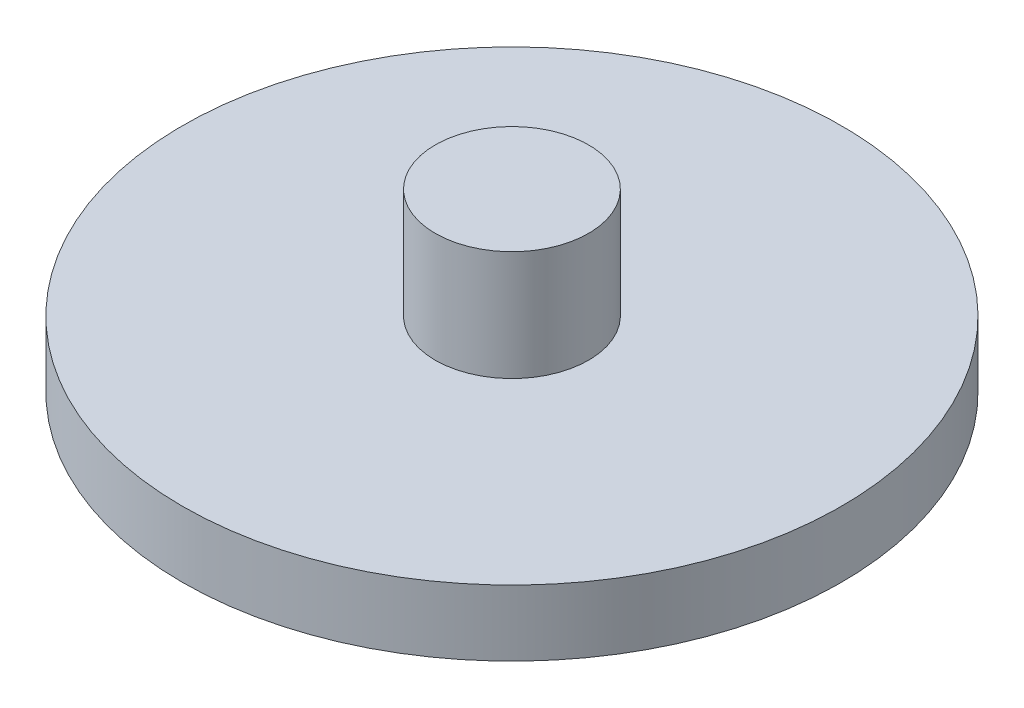
ISO-10303-21;
HEADER;
FILE_DESCRIPTION(('STEP AP214'),'2;1');
FILE_NAME('part.step','',(''),(''),'','','');
FILE_SCHEMA(('AUTOMOTIVE_DESIGN { 1 0 10303 214 1 1 1 1 }'));
ENDSEC;
DATA;
#1=APPLICATION_CONTEXT('core data for automotive mechanical design processes');
#2=APPLICATION_PROTOCOL_DEFINITION('international standard','automotive_design',2000,#1);
#3=PRODUCT_CONTEXT('',#1,'mechanical');
#4=PRODUCT('Part','Part','',(#3));
#5=PRODUCT_RELATED_PRODUCT_CATEGORY('part','',(#4));
#6=PRODUCT_DEFINITION_FORMATION('','',#4);
#7=PRODUCT_DEFINITION_CONTEXT('part definition',#1,'design');
#8=PRODUCT_DEFINITION('design','',#6,#7);
#9=PRODUCT_DEFINITION_SHAPE('','',#8);
#10=(LENGTH_UNIT() NAMED_UNIT(*) SI_UNIT(.MILLI.,.METRE.));
#11=(NAMED_UNIT(*) PLANE_ANGLE_UNIT() SI_UNIT($,.RADIAN.));
#12=(NAMED_UNIT(*) SI_UNIT($,.STERADIAN.) SOLID_ANGLE_UNIT());
#13=UNCERTAINTY_MEASURE_WITH_UNIT(LENGTH_MEASURE(1.E-05),#10,'distance_accuracy_value','');
#14=(GEOMETRIC_REPRESENTATION_CONTEXT(3) GLOBAL_UNCERTAINTY_ASSIGNED_CONTEXT((#13)) GLOBAL_UNIT_ASSIGNED_CONTEXT((#10,
#11,#12)) REPRESENTATION_CONTEXT('',''));
#15=CARTESIAN_POINT('',(0.,0.,0.));
#16=DIRECTION('',(0.,0.,1.));
#17=DIRECTION('',(1.,0.,0.));
#18=AXIS2_PLACEMENT_3D('',#15,#16,#17);
#19=CARTESIAN_POINT('',(0.,3.,0.));
#20=DIRECTION('',(0.,-1.,0.));
#21=DIRECTION('',(0.,0.,-1.));
#22=AXIS2_PLACEMENT_3D('',#19,#20,#21);
#23=CYLINDRICAL_SURFACE('',#22,15.);
#24=CARTESIAN_POINT('',(0.,3.,0.));
#25=DIRECTION('',(0.,1.,0.));
#26=DIRECTION('',(0.,0.,1.));
#27=AXIS2_PLACEMENT_3D('',#24,#25,#26);
#28=CIRCLE('',#27,15.);
#29=CARTESIAN_POINT('',(0.,3.,15.));
#30=VERTEX_POINT('',#29);
#31=EDGE_CURVE('E45',#30,#30,#28,.T.);
#32=ORIENTED_EDGE('',*,*,#31,.F.);
#33=EDGE_LOOP('',(#32));
#34=FACE_BOUND('',#33,.T.);
#35=CARTESIAN_POINT('',(0.,0.,0.));
#36=DIRECTION('',(0.,1.,0.));
#37=DIRECTION('',(0.,0.,1.));
#38=AXIS2_PLACEMENT_3D('',#35,#36,#37);
#39=CIRCLE('',#38,15.);
#40=CARTESIAN_POINT('',(0.,0.,15.));
#41=VERTEX_POINT('',#40);
#42=EDGE_CURVE('E40',#41,#41,#39,.T.);
#43=ORIENTED_EDGE('',*,*,#42,.T.);
#44=EDGE_LOOP('',(#43));
#45=FACE_BOUND('',#44,.T.);
#46=ADVANCED_FACE('F37',(#34,#45),#23,.T.);
#47=CARTESIAN_POINT('',(0.,3.,0.));
#48=DIRECTION('',(0.,1.,0.));
#49=DIRECTION('',(0.,0.,1.));
#50=AXIS2_PLACEMENT_3D('',#47,#48,#49);
#51=PLANE('',#50);
#52=CARTESIAN_POINT('',(0.,3.,0.));
#53=DIRECTION('',(0.,1.,0.));
#54=DIRECTION('',(0.,0.,1.));
#55=AXIS2_PLACEMENT_3D('',#52,#53,#54);
#56=CIRCLE('',#55,3.49);
#57=CARTESIAN_POINT('',(0.,3.,3.49));
#58=VERTEX_POINT('',#57);
#59=EDGE_CURVE('E10',#58,#58,#56,.T.);
#60=ORIENTED_EDGE('',*,*,#59,.F.);
#61=EDGE_LOOP('',(#60));
#62=FACE_BOUND('',#61,.T.);
#63=ORIENTED_EDGE('',*,*,#31,.T.);
#64=EDGE_LOOP('',(#63));
#65=FACE_BOUND('',#64,.T.);
#66=ADVANCED_FACE('F65',(#62,#65),#51,.T.);
#67=CARTESIAN_POINT('',(0.,0.,0.));
#68=DIRECTION('',(0.,1.,0.));
#69=DIRECTION('',(0.,0.,1.));
#70=AXIS2_PLACEMENT_3D('',#67,#68,#69);
#71=PLANE('',#70);
#72=ORIENTED_EDGE('',*,*,#42,.F.);
#73=EDGE_LOOP('',(#72));
#74=FACE_BOUND('',#73,.T.);
#75=ADVANCED_FACE('F62',(#74),#71,.F.);
#76=CARTESIAN_POINT('',(0.,8.,0.));
#77=DIRECTION('',(0.,-1.,0.));
#78=DIRECTION('',(0.,0.,-1.));
#79=AXIS2_PLACEMENT_3D('',#76,#77,#78);
#80=CYLINDRICAL_SURFACE('',#79,3.49);
#81=CARTESIAN_POINT('',(0.,8.,0.));
#82=DIRECTION('',(0.,1.,0.));
#83=DIRECTION('',(0.,0.,1.));
#84=AXIS2_PLACEMENT_3D('',#81,#82,#83);
#85=CIRCLE('',#84,3.49);
#86=CARTESIAN_POINT('',(0.,8.,3.49));
#87=VERTEX_POINT('',#86);
#88=EDGE_CURVE('E52',#87,#87,#85,.T.);
#89=ORIENTED_EDGE('',*,*,#88,.F.);
#90=EDGE_LOOP('',(#89));
#91=FACE_BOUND('',#90,.T.);
#92=ORIENTED_EDGE('',*,*,#59,.T.);
#93=EDGE_LOOP('',(#92));
#94=FACE_BOUND('',#93,.T.);
#95=ADVANCED_FACE('F64',(#91,#94),#80,.T.);
#96=CARTESIAN_POINT('',(0.,8.,0.));
#97=DIRECTION('',(0.,1.,0.));
#98=DIRECTION('',(0.,0.,1.));
#99=AXIS2_PLACEMENT_3D('',#96,#97,#98);
#100=PLANE('',#99);
#101=ORIENTED_EDGE('',*,*,#88,.T.);
#102=EDGE_LOOP('',(#101));
#103=FACE_BOUND('',#102,.T.);
#104=ADVANCED_FACE('F70',(#103),#100,.T.);
#105=CLOSED_SHELL('',(#46,#66,#75,#95,#104));
#106=MANIFOLD_SOLID_BREP('B2',#105);
#107=ADVANCED_BREP_SHAPE_REPRESENTATION('',(#18,#106),#14);
#108=SHAPE_DEFINITION_REPRESENTATION(#9,#107);
ENDSEC;
END-ISO-10303-21;
